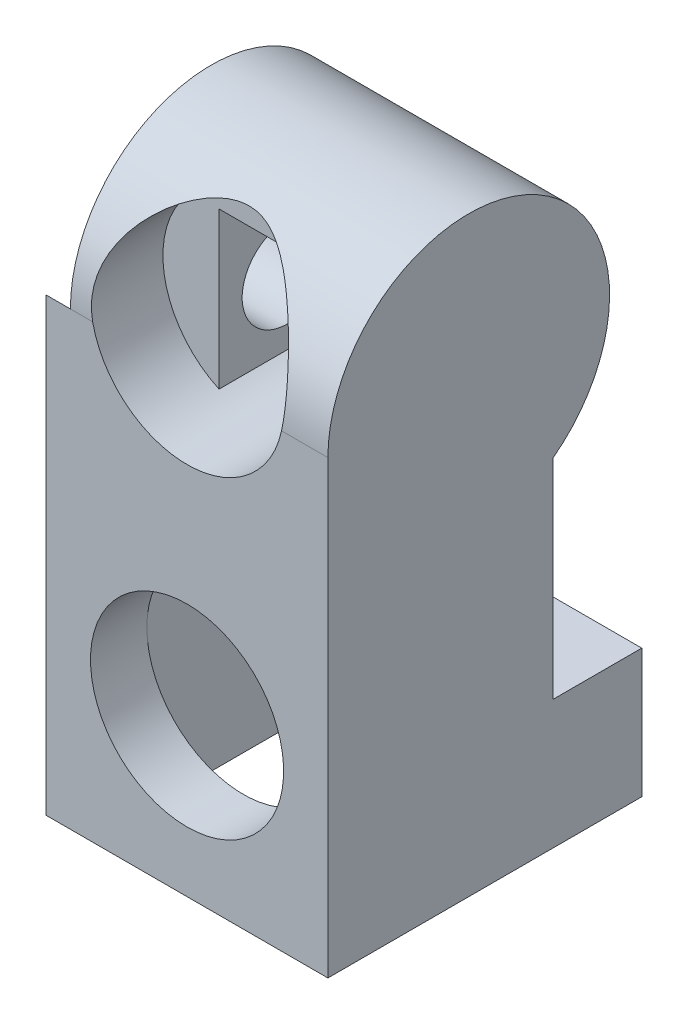
ISO-10303-21;
HEADER;
FILE_DESCRIPTION(('STEP AP214'),'2;1');
FILE_NAME('part.step','',(''),(''),'','','');
FILE_SCHEMA(('AUTOMOTIVE_DESIGN { 1 0 10303 214 1 1 1 1 }'));
ENDSEC;
DATA;
#1=APPLICATION_CONTEXT('core data for automotive mechanical design processes');
#2=APPLICATION_PROTOCOL_DEFINITION('international standard','automotive_design',2000,#1);
#3=PRODUCT_CONTEXT('',#1,'mechanical');
#4=PRODUCT('Part','Part','',(#3));
#5=PRODUCT_RELATED_PRODUCT_CATEGORY('part','',(#4));
#6=PRODUCT_DEFINITION_FORMATION('','',#4);
#7=PRODUCT_DEFINITION_CONTEXT('part definition',#1,'design');
#8=PRODUCT_DEFINITION('design','',#6,#7);
#9=PRODUCT_DEFINITION_SHAPE('','',#8);
#10=(LENGTH_UNIT() NAMED_UNIT(*) SI_UNIT(.MILLI.,.METRE.));
#11=(NAMED_UNIT(*) PLANE_ANGLE_UNIT() SI_UNIT($,.RADIAN.));
#12=(NAMED_UNIT(*) SI_UNIT($,.STERADIAN.) SOLID_ANGLE_UNIT());
#13=UNCERTAINTY_MEASURE_WITH_UNIT(LENGTH_MEASURE(1.E-05),#10,'distance_accuracy_value','');
#14=(GEOMETRIC_REPRESENTATION_CONTEXT(3) GLOBAL_UNCERTAINTY_ASSIGNED_CONTEXT((#13)) GLOBAL_UNIT_ASSIGNED_CONTEXT((#10,
#11,#12)) REPRESENTATION_CONTEXT('',''));
#15=CARTESIAN_POINT('',(0.,0.,0.));
#16=DIRECTION('',(0.,0.,1.));
#17=DIRECTION('',(1.,0.,0.));
#18=AXIS2_PLACEMENT_3D('',#15,#16,#17);
#19=CARTESIAN_POINT('',(-3.5,0.499999999999999,1.7));
#20=DIRECTION('',(0.,0.,1.));
#21=DIRECTION('',(0.,1.,0.));
#22=AXIS2_PLACEMENT_3D('',#19,#20,#21);
#23=PLANE('',#22);
#24=DIRECTION('',(-1.,0.,0.));
#25=VECTOR('',#24,1.);
#26=CARTESIAN_POINT('',(0.,2.2,1.7));
#27=LINE('',#26,#25);
#28=CARTESIAN_POINT('',(-1.80589256539026,2.2,1.7));
#29=VERTEX_POINT('',#28);
#30=CARTESIAN_POINT('',(-4.50589256539026,2.2,1.7));
#31=VERTEX_POINT('',#30);
#32=EDGE_CURVE('E198',#29,#31,#27,.T.);
#33=ORIENTED_EDGE('',*,*,#32,.F.);
#34=CARTESIAN_POINT('',(-3.5,0.499999999999999,1.7));
#35=DIRECTION('',(0.,0.,-1.));
#36=DIRECTION('',(0.,1.,0.));
#37=AXIS2_PLACEMENT_3D('',#34,#35,#36);
#38=CIRCLE('',#37,2.4);
#39=CARTESIAN_POINT('',(-4.50589256539026,-1.67903192883735,1.7));
#40=VERTEX_POINT('',#39);
#41=EDGE_CURVE('E200',#40,#29,#38,.T.);
#42=ORIENTED_EDGE('',*,*,#41,.F.);
#43=DIRECTION('',(0.,-1.,0.));
#44=VECTOR('',#43,1.);
#45=CARTESIAN_POINT('',(-4.50589256539026,0.,1.7));
#46=LINE('',#45,#44);
#47=EDGE_CURVE('E190',#31,#40,#46,.T.);
#48=ORIENTED_EDGE('',*,*,#47,.F.);
#49=EDGE_LOOP('',(#33,#42,#48));
#50=FACE_BOUND('',#49,.T.);
#51=ADVANCED_FACE('F43',(#50),#23,.T.);
#52=CARTESIAN_POINT('',(-1.80589256539026,-1.2,1.7));
#53=VERTEX_POINT('',#52);
#54=EDGE_CURVE('E401',#29,#53,#38,.T.);
#55=ORIENTED_EDGE('',*,*,#54,.F.);
#56=DIRECTION('',(0.,1.,0.));
#57=VECTOR('',#56,1.);
#58=CARTESIAN_POINT('',(-1.80589256539026,0.,1.7));
#59=LINE('',#58,#57);
#60=EDGE_CURVE('E392',#53,#29,#59,.T.);
#61=ORIENTED_EDGE('',*,*,#60,.F.);
#62=EDGE_LOOP('',(#55,#61));
#63=FACE_BOUND('',#62,.T.);
#64=ADVANCED_FACE('F256',(#63),#23,.T.);
#65=CARTESIAN_POINT('',(0.,-2.3,2.1));
#66=DIRECTION('',(0.,0.,1.));
#67=DIRECTION('',(0.,1.,0.));
#68=AXIS2_PLACEMENT_3D('',#65,#66,#67);
#69=PLANE('',#68);
#70=DIRECTION('',(0.,-1.,0.));
#71=VECTOR('',#70,1.);
#72=CARTESIAN_POINT('',(-1.1,-2.3,2.1));
#73=LINE('',#72,#71);
#74=CARTESIAN_POINT('',(-1.1,-7.3,2.1));
#75=VERTEX_POINT('',#74);
#76=CARTESIAN_POINT('',(-1.1,-11.2,2.1));
#77=VERTEX_POINT('',#76);
#78=EDGE_CURVE('E310',#75,#77,#73,.T.);
#79=ORIENTED_EDGE('',*,*,#78,.T.);
#80=DIRECTION('',(1.,0.,0.));
#81=VECTOR('',#80,1.);
#82=CARTESIAN_POINT('',(0.,-11.2,2.1));
#83=LINE('',#82,#81);
#84=CARTESIAN_POINT('',(-5.9,-11.2,2.1));
#85=VERTEX_POINT('',#84);
#86=EDGE_CURVE('E297',#85,#77,#83,.T.);
#87=ORIENTED_EDGE('',*,*,#86,.F.);
#88=DIRECTION('',(0.,-1.,0.));
#89=VECTOR('',#88,1.);
#90=CARTESIAN_POINT('',(-5.9,-2.3,2.1));
#91=LINE('',#90,#89);
#92=CARTESIAN_POINT('',(-5.9,-7.3,2.1));
#93=VERTEX_POINT('',#92);
#94=EDGE_CURVE('E322',#93,#85,#91,.T.);
#95=ORIENTED_EDGE('',*,*,#94,.F.);
#96=CARTESIAN_POINT('',(-3.5,-7.3,2.1));
#97=DIRECTION('',(0.,0.,-1.));
#98=DIRECTION('',(0.,1.,0.));
#99=AXIS2_PLACEMENT_3D('',#96,#97,#98);
#100=CIRCLE('',#99,2.4);
#101=EDGE_CURVE('E278',#75,#93,#100,.T.);
#102=ORIENTED_EDGE('',*,*,#101,.F.);
#103=EDGE_LOOP('',(#79,#87,#95,#102));
#104=FACE_BOUND('',#103,.T.);
#105=ADVANCED_FACE('F260',(#104),#69,.F.);
#106=CARTESIAN_POINT('',(-7.,-11.2,0.));
#107=DIRECTION('',(0.,1.,0.));
#108=DIRECTION('',(0.,0.,-1.));
#109=AXIS2_PLACEMENT_3D('',#106,#107,#108);
#110=PLANE('',#109);
#111=DIRECTION('',(0.,0.,-1.));
#112=VECTOR('',#111,1.);
#113=CARTESIAN_POINT('',(0.,-11.2,0.));
#114=LINE('',#113,#112);
#115=CARTESIAN_POINT('',(0.,-11.2,3.5));
#116=VERTEX_POINT('',#115);
#117=CARTESIAN_POINT('',(0.,-11.2,-4.3));
#118=VERTEX_POINT('',#117);
#119=EDGE_CURVE('E357',#116,#118,#114,.T.);
#120=ORIENTED_EDGE('',*,*,#119,.F.);
#121=DIRECTION('',(1.,0.,0.));
#122=VECTOR('',#121,1.);
#123=CARTESIAN_POINT('',(-7.,-11.2,3.5));
#124=LINE('',#123,#122);
#125=CARTESIAN_POINT('',(-7.,-11.2,3.5));
#126=VERTEX_POINT('',#125);
#127=EDGE_CURVE('E366',#126,#116,#124,.T.);
#128=ORIENTED_EDGE('',*,*,#127,.F.);
#129=DIRECTION('',(0.,0.,-1.));
#130=VECTOR('',#129,1.);
#131=CARTESIAN_POINT('',(-7.,-11.2,0.));
#132=LINE('',#131,#130);
#133=CARTESIAN_POINT('',(-7.,-11.2,-4.3));
#134=VERTEX_POINT('',#133);
#135=EDGE_CURVE('E344',#126,#134,#132,.T.);
#136=ORIENTED_EDGE('',*,*,#135,.T.);
#137=DIRECTION('',(1.,0.,0.));
#138=VECTOR('',#137,1.);
#139=CARTESIAN_POINT('',(-7.,-11.2,-4.3));
#140=LINE('',#139,#138);
#141=EDGE_CURVE('E369',#134,#118,#140,.T.);
#142=ORIENTED_EDGE('',*,*,#141,.T.);
#143=EDGE_LOOP('',(#120,#128,#136,#142));
#144=FACE_BOUND('',#143,.T.);
#145=DIRECTION('',(0.,0.,-1.));
#146=VECTOR('',#145,1.);
#147=CARTESIAN_POINT('',(-5.9,-11.2,0.));
#148=LINE('',#147,#146);
#149=CARTESIAN_POINT('',(-5.9,-11.2,-2.9));
#150=VERTEX_POINT('',#149);
#151=EDGE_CURVE('E303',#85,#150,#148,.T.);
#152=ORIENTED_EDGE('',*,*,#151,.F.);
#153=ORIENTED_EDGE('',*,*,#86,.T.);
#154=DIRECTION('',(0.,0.,-1.));
#155=VECTOR('',#154,1.);
#156=CARTESIAN_POINT('',(-1.1,-11.2,0.));
#157=LINE('',#156,#155);
#158=CARTESIAN_POINT('',(-1.1,-11.2,-2.9));
#159=VERTEX_POINT('',#158);
#160=EDGE_CURVE('E313',#77,#159,#157,.T.);
#161=ORIENTED_EDGE('',*,*,#160,.T.);
#162=DIRECTION('',(1.,0.,0.));
#163=VECTOR('',#162,1.);
#164=CARTESIAN_POINT('',(0.,-11.2,-2.9));
#165=LINE('',#164,#163);
#166=EDGE_CURVE('E277',#150,#159,#165,.T.);
#167=ORIENTED_EDGE('',*,*,#166,.F.);
#168=EDGE_LOOP('',(#152,#153,#161,#167));
#169=FACE_BOUND('',#168,.T.);
#170=ADVANCED_FACE('F430',(#144,#169),#110,.F.);
#171=CARTESIAN_POINT('',(0.,-2.3,-1.2));
#172=DIRECTION('',(0.,0.,1.));
#173=DIRECTION('',(0.,1.,0.));
#174=AXIS2_PLACEMENT_3D('',#171,#172,#173);
#175=PLANE('',#174);
#176=DIRECTION('',(0.,-1.,0.));
#177=VECTOR('',#176,1.);
#178=CARTESIAN_POINT('',(-1.1,-2.3,-1.2));
#179=LINE('',#178,#177);
#180=CARTESIAN_POINT('',(-1.1,-2.3,-1.2));
#181=VERTEX_POINT('',#180);
#182=CARTESIAN_POINT('',(-1.1,-9.2,-1.2));
#183=VERTEX_POINT('',#182);
#184=EDGE_CURVE('E326',#181,#183,#179,.T.);
#185=ORIENTED_EDGE('',*,*,#184,.F.);
#186=DIRECTION('',(1.,0.,0.));
#187=VECTOR('',#186,1.);
#188=CARTESIAN_POINT('',(0.,-2.3,-1.2));
#189=LINE('',#188,#187);
#190=CARTESIAN_POINT('',(-5.9,-2.3,-1.2));
#191=VERTEX_POINT('',#190);
#192=EDGE_CURVE('E305',#191,#181,#189,.T.);
#193=ORIENTED_EDGE('',*,*,#192,.F.);
#194=DIRECTION('',(0.,-1.,0.));
#195=VECTOR('',#194,1.);
#196=CARTESIAN_POINT('',(-5.9,-2.3,-1.2));
#197=LINE('',#196,#195);
#198=CARTESIAN_POINT('',(-5.9,-9.2,-1.2));
#199=VERTEX_POINT('',#198);
#200=EDGE_CURVE('E323',#191,#199,#197,.T.);
#201=ORIENTED_EDGE('',*,*,#200,.T.);
#202=DIRECTION('',(1.,0.,0.));
#203=VECTOR('',#202,1.);
#204=CARTESIAN_POINT('',(0.,-9.2,-1.2));
#205=LINE('',#204,#203);
#206=EDGE_CURVE('E281',#199,#183,#205,.T.);
#207=ORIENTED_EDGE('',*,*,#206,.T.);
#208=EDGE_LOOP('',(#185,#193,#201,#207));
#209=FACE_BOUND('',#208,.T.);
#210=ADVANCED_FACE('F440',(#209),#175,.T.);
#211=CARTESIAN_POINT('',(-6.4,0.,0.));
#212=DIRECTION('',(1.,0.,0.));
#213=DIRECTION('',(0.,0.,1.));
#214=AXIS2_PLACEMENT_3D('',#211,#212,#213);
#215=CYLINDRICAL_SURFACE('',#214,3.5);
#216=CARTESIAN_POINT('',(-5.8473389188611,0.,3.5));
#217=CARTESIAN_POINT('',(-5.85952324799212,0.0571477217374245,3.50001181867057));
#218=CARTESIAN_POINT('',(-5.86959863933398,0.114743770065322,3.49860061614223));
#219=CARTESIAN_POINT('',(-5.88551560428378,0.230360407827148,3.49288728833139));
#220=CARTESIAN_POINT('',(-5.89135828784083,0.288380881929227,3.48858592151156));
#221=CARTESIAN_POINT('',(-5.8987800738924,0.404089359673819,3.47707880110764));
#222=CARTESIAN_POINT('',(-5.90038218120077,0.461777456069779,3.46988896332483));
#223=CARTESIAN_POINT('',(-5.89946378384657,0.576676567862824,3.45265487837301));
#224=CARTESIAN_POINT('',(-5.89694326407962,0.633887581511211,3.44261062074615));
#225=CARTESIAN_POINT('',(-5.88336595556229,0.804105036209102,3.4083356117771));
#226=CARTESIAN_POINT('',(-5.86630384227635,0.915869866292524,3.37994514796454));
#227=CARTESIAN_POINT('',(-5.8176646602164,1.13314832429677,3.31344895138059));
#228=CARTESIAN_POINT('',(-5.78607230536925,1.23865523648251,3.27533300607753));
#229=CARTESIAN_POINT('',(-5.70809491628295,1.44731564674367,3.18884504357403));
#230=CARTESIAN_POINT('',(-5.66097838899282,1.55000373794561,3.14001706082533));
#231=CARTESIAN_POINT('',(-5.55467670041225,1.74526360748642,3.03584021966201));
#232=CARTESIAN_POINT('',(-5.49548649772665,1.83783113507598,2.98048864139242));
#233=CARTESIAN_POINT('',(-5.35353573776811,2.03018562272158,2.85379750966277));
#234=CARTESIAN_POINT('',(-5.26842986956987,2.12760502281981,2.78149734246403));
#235=CARTESIAN_POINT('',(-5.08471660055204,2.30698502977076,2.63462775579363));
#236=CARTESIAN_POINT('',(-4.98609165576466,2.38892521486053,2.56005548720432));
#237=CARTESIAN_POINT('',(-4.78326463330636,2.53162908276111,2.41871956278776));
#238=CARTESIAN_POINT('',(-4.67995301376685,2.59348192527748,2.3517770338946));
#239=CARTESIAN_POINT('',(-4.46138451080996,2.70240840583052,2.22572729179699));
#240=CARTESIAN_POINT('',(-4.34615403536233,2.74951382379002,2.16660339102304));
#241=CARTESIAN_POINT('',(-4.14772757712701,2.81234304649958,2.08383834027692));
#242=CARTESIAN_POINT('',(-4.06831867472429,2.83323788763357,2.05514190190293));
#243=CARTESIAN_POINT('',(-3.90499381872968,2.86704539023274,2.0077106103014));
#244=CARTESIAN_POINT('',(-3.82108827656746,2.87997569256307,1.98895375460871));
#245=CARTESIAN_POINT('',(-3.64949120839477,2.89690144617537,1.9642337035912));
#246=CARTESIAN_POINT('',(-3.56176894903616,2.9008005995437,1.95840842288825));
#247=CARTESIAN_POINT('',(-3.38665261282273,2.89892227463506,1.96118525247281));
#248=CARTESIAN_POINT('',(-3.2992586376826,2.89314201115589,1.96979151536346));
#249=CARTESIAN_POINT('',(-3.11997573015766,2.8716013071517,2.00106904761721));
#250=CARTESIAN_POINT('',(-3.02841815728649,2.85496763238069,2.02496702821199));
#251=CARTESIAN_POINT('',(-2.85105317430008,2.81241019263363,2.08366151371945));
#252=CARTESIAN_POINT('',(-2.76526360077856,2.78645905439294,2.11849009267811));
#253=CARTESIAN_POINT('',(-2.61773079012411,2.73301571417905,2.18679788954713));
#254=CARTESIAN_POINT('',(-2.55478723431316,2.70705840232988,2.21895300854012));
#255=CARTESIAN_POINT('',(-2.43253952688268,2.6505953738598,2.28610481874926));
#256=CARTESIAN_POINT('',(-2.37323749385825,2.62008704424715,2.32110313711189));
#257=CARTESIAN_POINT('',(-2.20045968614499,2.52207206221611,2.42868720689749));
#258=CARTESIAN_POINT('',(-2.09218099861509,2.44810107186269,2.50382746204864));
#259=CARTESIAN_POINT('',(-1.88360823330201,2.27939132717921,2.65861963929727));
#260=CARTESIAN_POINT('',(-1.78407812901597,2.18373583955496,2.73829291655651));
#261=CARTESIAN_POINT('',(-1.60137340449738,1.97459276266238,2.89271972414267));
#262=CARTESIAN_POINT('',(-1.51817479248159,1.86113177857625,2.96748036225121));
#263=CARTESIAN_POINT('',(-1.38270764696269,1.63641660452186,3.09615262794246));
#264=CARTESIAN_POINT('',(-1.32762439761678,1.52768128659245,3.15148910825451));
#265=CARTESIAN_POINT('',(-1.23355837193325,1.29903752936263,3.25238946581503));
#266=CARTESIAN_POINT('',(-1.19457083515538,1.17913240650188,3.29795623061859));
#267=CARTESIAN_POINT('',(-1.15017085451829,0.992412245075306,3.35700281785587));
#268=CARTESIAN_POINT('',(-1.13769076115729,0.928685601014822,3.37520301505509));
#269=CARTESIAN_POINT('',(-1.11787508897714,0.799562026687033,3.40809707788925));
#270=CARTESIAN_POINT('',(-1.11053670135105,0.734166028622351,3.42279285501696));
#271=CARTESIAN_POINT('',(-1.1012748142032,0.602361890112999,3.44842924317227));
#272=CARTESIAN_POINT('',(-1.09934358386222,0.53595533132392,3.45937519578144));
#273=CARTESIAN_POINT('',(-1.10104813363846,0.402723056835072,3.47740236223998));
#274=CARTESIAN_POINT('',(-1.10468020548551,0.335897649885473,3.4844861461866));
#275=CARTESIAN_POINT('',(-1.1154853741884,0.224046580330871,3.49311564200003));
#276=CARTESIAN_POINT('',(-1.12113712347402,0.178946589127799,3.49571088870466));
#277=CARTESIAN_POINT('',(-1.1349923537418,0.0891432677126922,3.49915350020635));
#278=CARTESIAN_POINT('',(-1.14319194086814,0.0444394385561715,3.50000351725482));
#279=CARTESIAN_POINT('',(-1.15266108113889,0.,3.5));
#280=B_SPLINE_CURVE_WITH_KNOTS('',3,(#216,#217,#218,#219,#220,#221,#222,#223,#224,#225,#226,
#227,#228,#229,#230,#231,#232,#233,#234,#235,#236,#237,#238,#239,#240,#241,#242,#243,#244,#245,
#246,#247,#248,#249,#250,#251,#252,#253,#254,#255,#256,#257,#258,#259,#260,#261,#262,#263,#264,
#265,#266,#267,#268,#269,#270,#271,#272,#273,#274,#275,#276,#277,#278,#279),.UNSPECIFIED.,.F.,
.F.,(4,2,2,2,2,2,2,2,2,2,2,2,2,2,2,2,2,2,2,2,2,2,2,2,2,2,2,2,2,2,2,4),(0.,0.175237440381033,
0.35042891134353,0.524668014814338,0.698907756660255,1.04686867533735,1.39519649537508,
1.76309807782818,2.13115359418281,2.57414809278723,3.01772301461145,3.42986501795747,
3.84111266440891,4.10124897819194,4.36080701764205,4.62312019539684,4.88550886538463,
5.17215450827924,5.45964925644542,5.68524281978454,5.91096641102046,6.36265437457839,
6.83912330739456,7.31488695708917,7.71498529590946,8.1149652174138,8.31702682714792,
8.51897796858323,8.720640224955,8.92216811998134,9.05864817270439,9.19492066068158),.UNSPECIFIED.);
#281=CARTESIAN_POINT('',(-5.8473389188611,0.,3.5));
#282=VERTEX_POINT('',#281);
#283=CARTESIAN_POINT('',(-1.1526610811389,0.,3.5));
#284=VERTEX_POINT('',#283);
#285=EDGE_CURVE('E269',#282,#284,#280,.T.);
#286=ORIENTED_EDGE('',*,*,#285,.T.);
#287=DIRECTION('',(1.,0.,0.));
#288=VECTOR('',#287,1.);
#289=CARTESIAN_POINT('',(-7.,0.,3.5));
#290=LINE('',#289,#288);
#291=CARTESIAN_POINT('',(0.,0.,3.5));
#292=VERTEX_POINT('',#291);
#293=EDGE_CURVE('E365',#284,#292,#290,.T.);
#294=ORIENTED_EDGE('',*,*,#293,.T.);
#295=CARTESIAN_POINT('',(0.,0.,0.));
#296=DIRECTION('',(-1.,0.,0.));
#297=DIRECTION('',(0.,0.,1.));
#298=AXIS2_PLACEMENT_3D('',#295,#296,#297);
#299=CIRCLE('',#298,3.5);
#300=CARTESIAN_POINT('',(0.,-2.8,-2.1));
#301=VERTEX_POINT('',#300);
#302=EDGE_CURVE('E55',#292,#301,#299,.T.);
#303=ORIENTED_EDGE('',*,*,#302,.T.);
#304=DIRECTION('',(1.,0.,0.));
#305=VECTOR('',#304,1.);
#306=CARTESIAN_POINT('',(-7.,-2.8,-2.1));
#307=LINE('',#306,#305);
#308=CARTESIAN_POINT('',(-6.4,-2.8,-2.1));
#309=VERTEX_POINT('',#308);
#310=EDGE_CURVE('E349',#309,#301,#307,.T.);
#311=ORIENTED_EDGE('',*,*,#310,.F.);
#312=CARTESIAN_POINT('',(-6.4,0.,0.));
#313=DIRECTION('',(-1.,0.,0.));
#314=DIRECTION('',(0.,0.,1.));
#315=AXIS2_PLACEMENT_3D('',#312,#313,#314);
#316=CIRCLE('',#315,3.5);
#317=CARTESIAN_POINT('',(-6.4,0.,3.5));
#318=VERTEX_POINT('',#317);
#319=EDGE_CURVE('E12',#318,#309,#316,.T.);
#320=ORIENTED_EDGE('',*,*,#319,.F.);
#321=EDGE_CURVE('E364',#318,#282,#290,.T.);
#322=ORIENTED_EDGE('',*,*,#321,.T.);
#323=EDGE_LOOP('',(#286,#294,#303,#311,#320,#322));
#324=FACE_BOUND('',#323,.T.);
#325=ADVANCED_FACE('F45',(#324),#215,.T.);
#326=CARTESIAN_POINT('',(-6.4,0.,0.));
#327=DIRECTION('',(1.,0.,0.));
#328=DIRECTION('',(0.,0.,1.));
#329=AXIS2_PLACEMENT_3D('',#326,#327,#328);
#330=PLANE('',#329);
#331=CARTESIAN_POINT('',(-6.4,0.,0.));
#332=DIRECTION('',(1.,0.,0.));
#333=DIRECTION('',(0.,0.,-1.));
#334=AXIS2_PLACEMENT_3D('',#331,#332,#333);
#335=CIRCLE('',#334,1.125);
#336=CARTESIAN_POINT('',(-6.4,0.,-1.125));
#337=VERTEX_POINT('',#336);
#338=EDGE_CURVE('E205',#337,#337,#335,.T.);
#339=ORIENTED_EDGE('',*,*,#338,.T.);
#340=EDGE_LOOP('',(#339));
#341=FACE_BOUND('',#340,.T.);
#342=ORIENTED_EDGE('',*,*,#319,.T.);
#343=CARTESIAN_POINT('',(-6.4,0.,0.));
#344=DIRECTION('',(-1.,0.,0.));
#345=DIRECTION('',(0.,0.,1.));
#346=AXIS2_PLACEMENT_3D('',#343,#344,#345);
#347=CIRCLE('',#346,3.5);
#348=EDGE_CURVE('E363',#309,#318,#347,.T.);
#349=ORIENTED_EDGE('',*,*,#348,.T.);
#350=EDGE_LOOP('',(#342,#349));
#351=FACE_BOUND('',#350,.T.);
#352=ADVANCED_FACE('F487',(#341,#351),#330,.F.);
#353=CARTESIAN_POINT('',(0.,0.,0.));
#354=DIRECTION('',(1.,0.,0.));
#355=DIRECTION('',(0.,0.,1.));
#356=AXIS2_PLACEMENT_3D('',#353,#354,#355);
#357=PLANE('',#356);
#358=ORIENTED_EDGE('',*,*,#302,.F.);
#359=DIRECTION('',(0.,-1.,0.));
#360=VECTOR('',#359,1.);
#361=CARTESIAN_POINT('',(0.,0.,3.5));
#362=LINE('',#361,#360);
#363=EDGE_CURVE('E336',#292,#116,#362,.T.);
#364=ORIENTED_EDGE('',*,*,#363,.T.);
#365=ORIENTED_EDGE('',*,*,#119,.T.);
#366=DIRECTION('',(0.,1.,0.));
#367=VECTOR('',#366,1.);
#368=CARTESIAN_POINT('',(0.,0.,-4.29999999999999));
#369=LINE('',#368,#367);
#370=CARTESIAN_POINT('',(0.,-8.,-4.3));
#371=VERTEX_POINT('',#370);
#372=EDGE_CURVE('E354',#118,#371,#369,.T.);
#373=ORIENTED_EDGE('',*,*,#372,.T.);
#374=DIRECTION('',(0.,0.,1.));
#375=VECTOR('',#374,1.);
#376=CARTESIAN_POINT('',(0.,-8.,0.));
#377=LINE('',#376,#375);
#378=CARTESIAN_POINT('',(0.,-8.,-2.1));
#379=VERTEX_POINT('',#378);
#380=EDGE_CURVE('E351',#371,#379,#377,.T.);
#381=ORIENTED_EDGE('',*,*,#380,.T.);
#382=DIRECTION('',(0.,1.,0.));
#383=VECTOR('',#382,1.);
#384=CARTESIAN_POINT('',(0.,0.,-2.1));
#385=LINE('',#384,#383);
#386=EDGE_CURVE('E321',#379,#301,#385,.T.);
#387=ORIENTED_EDGE('',*,*,#386,.T.);
#388=EDGE_LOOP('',(#358,#364,#365,#373,#381,#387));
#389=FACE_BOUND('',#388,.T.);
#390=ADVANCED_FACE('F485',(#389),#357,.T.);
#391=CARTESIAN_POINT('',(-7.,0.,0.));
#392=DIRECTION('',(1.,0.,0.));
#393=DIRECTION('',(0.,0.,1.));
#394=AXIS2_PLACEMENT_3D('',#391,#392,#393);
#395=CYLINDRICAL_SURFACE('',#394,3.5);
#396=CARTESIAN_POINT('',(-7.,-2.8,-2.1));
#397=VERTEX_POINT('',#396);
#398=EDGE_CURVE('E376',#397,#309,#307,.T.);
#399=ORIENTED_EDGE('',*,*,#398,.F.);
#400=CARTESIAN_POINT('',(-7.,0.,0.));
#401=DIRECTION('',(-1.,0.,0.));
#402=DIRECTION('',(0.,0.,1.));
#403=AXIS2_PLACEMENT_3D('',#400,#401,#402);
#404=CIRCLE('',#403,3.5);
#405=CARTESIAN_POINT('',(-7.,0.,3.5));
#406=VERTEX_POINT('',#405);
#407=EDGE_CURVE('E332',#397,#406,#404,.T.);
#408=ORIENTED_EDGE('',*,*,#407,.T.);
#409=EDGE_CURVE('E361',#406,#318,#290,.T.);
#410=ORIENTED_EDGE('',*,*,#409,.T.);
#411=ORIENTED_EDGE('',*,*,#348,.F.);
#412=EDGE_LOOP('',(#399,#408,#410,#411));
#413=FACE_BOUND('',#412,.T.);
#414=ADVANCED_FACE('F469',(#413),#395,.F.);
#415=CARTESIAN_POINT('',(-7.,0.,3.5));
#416=DIRECTION('',(0.,0.,-1.));
#417=DIRECTION('',(0.,-1.,0.));
#418=AXIS2_PLACEMENT_3D('',#415,#416,#417);
#419=PLANE('',#418);
#420=CARTESIAN_POINT('',(-3.5,-7.3,3.5));
#421=DIRECTION('',(0.,0.,-1.));
#422=DIRECTION('',(0.,1.,0.));
#423=AXIS2_PLACEMENT_3D('',#420,#421,#422);
#424=CIRCLE('',#423,2.4);
#425=CARTESIAN_POINT('',(-3.5,-4.9,3.5));
#426=VERTEX_POINT('',#425);
#427=EDGE_CURVE('E201',#426,#426,#424,.T.);
#428=ORIENTED_EDGE('',*,*,#427,.T.);
#429=EDGE_LOOP('',(#428));
#430=FACE_BOUND('',#429,.T.);
#431=ORIENTED_EDGE('',*,*,#321,.F.);
#432=ORIENTED_EDGE('',*,*,#409,.F.);
#433=DIRECTION('',(0.,-1.,0.));
#434=VECTOR('',#433,1.);
#435=CARTESIAN_POINT('',(-7.,0.,3.5));
#436=LINE('',#435,#434);
#437=EDGE_CURVE('E347',#406,#126,#436,.T.);
#438=ORIENTED_EDGE('',*,*,#437,.T.);
#439=ORIENTED_EDGE('',*,*,#127,.T.);
#440=ORIENTED_EDGE('',*,*,#363,.F.);
#441=ORIENTED_EDGE('',*,*,#293,.F.);
#442=CARTESIAN_POINT('',(-3.5,0.499999999999999,3.5));
#443=DIRECTION('',(0.,0.,-1.));
#444=DIRECTION('',(0.,1.,0.));
#445=AXIS2_PLACEMENT_3D('',#442,#443,#444);
#446=CIRCLE('',#445,2.4);
#447=EDGE_CURVE('E70',#284,#282,#446,.T.);
#448=ORIENTED_EDGE('',*,*,#447,.T.);
#449=EDGE_LOOP('',(#431,#432,#438,#439,#440,#441,#448));
#450=FACE_BOUND('',#449,.T.);
#451=ADVANCED_FACE('F406',(#430,#450),#419,.F.);
#452=CARTESIAN_POINT('',(-7.,0.,-4.29999999999999));
#453=DIRECTION('',(0.,0.,1.));
#454=DIRECTION('',(0.,1.,0.));
#455=AXIS2_PLACEMENT_3D('',#452,#453,#454);
#456=PLANE('',#455);
#457=ORIENTED_EDGE('',*,*,#372,.F.);
#458=ORIENTED_EDGE('',*,*,#141,.F.);
#459=DIRECTION('',(0.,1.,0.));
#460=VECTOR('',#459,1.);
#461=CARTESIAN_POINT('',(-7.,0.,-4.29999999999999));
#462=LINE('',#461,#460);
#463=CARTESIAN_POINT('',(-7.,-8.,-4.3));
#464=VERTEX_POINT('',#463);
#465=EDGE_CURVE('E341',#134,#464,#462,.T.);
#466=ORIENTED_EDGE('',*,*,#465,.T.);
#467=DIRECTION('',(1.,0.,0.));
#468=VECTOR('',#467,1.);
#469=CARTESIAN_POINT('',(-7.,-8.,-4.3));
#470=LINE('',#469,#468);
#471=EDGE_CURVE('E372',#464,#371,#470,.T.);
#472=ORIENTED_EDGE('',*,*,#471,.T.);
#473=EDGE_LOOP('',(#457,#458,#466,#472));
#474=FACE_BOUND('',#473,.T.);
#475=ADVANCED_FACE('F468',(#474),#456,.F.);
#476=CARTESIAN_POINT('',(-7.,-8.,0.));
#477=DIRECTION('',(0.,-1.,0.));
#478=DIRECTION('',(0.,0.,1.));
#479=AXIS2_PLACEMENT_3D('',#476,#477,#478);
#480=PLANE('',#479);
#481=ORIENTED_EDGE('',*,*,#380,.F.);
#482=ORIENTED_EDGE('',*,*,#471,.F.);
#483=DIRECTION('',(0.,0.,1.));
#484=VECTOR('',#483,1.);
#485=CARTESIAN_POINT('',(-7.,-8.,0.));
#486=LINE('',#485,#484);
#487=CARTESIAN_POINT('',(-7.,-8.,-2.1));
#488=VERTEX_POINT('',#487);
#489=EDGE_CURVE('E338',#464,#488,#486,.T.);
#490=ORIENTED_EDGE('',*,*,#489,.T.);
#491=DIRECTION('',(1.,0.,0.));
#492=VECTOR('',#491,1.);
#493=CARTESIAN_POINT('',(-7.,-8.,-2.1));
#494=LINE('',#493,#492);
#495=EDGE_CURVE('E374',#488,#379,#494,.T.);
#496=ORIENTED_EDGE('',*,*,#495,.T.);
#497=EDGE_LOOP('',(#481,#482,#490,#496));
#498=FACE_BOUND('',#497,.T.);
#499=ADVANCED_FACE('F475',(#498),#480,.F.);
#500=CARTESIAN_POINT('',(-7.,0.,-2.1));
#501=DIRECTION('',(0.,0.,1.));
#502=DIRECTION('',(0.,1.,0.));
#503=AXIS2_PLACEMENT_3D('',#500,#501,#502);
#504=PLANE('',#503);
#505=ORIENTED_EDGE('',*,*,#386,.F.);
#506=ORIENTED_EDGE('',*,*,#495,.F.);
#507=DIRECTION('',(0.,1.,0.));
#508=VECTOR('',#507,1.);
#509=CARTESIAN_POINT('',(-7.,0.,-2.1));
#510=LINE('',#509,#508);
#511=EDGE_CURVE('E335',#488,#397,#510,.T.);
#512=ORIENTED_EDGE('',*,*,#511,.T.);
#513=ORIENTED_EDGE('',*,*,#398,.T.);
#514=ORIENTED_EDGE('',*,*,#310,.T.);
#515=EDGE_LOOP('',(#505,#506,#512,#513,#514));
#516=FACE_BOUND('',#515,.T.);
#517=ADVANCED_FACE('F464',(#516),#504,.F.);
#518=CARTESIAN_POINT('',(-7.,0.,0.));
#519=DIRECTION('',(1.,0.,0.));
#520=DIRECTION('',(0.,0.,1.));
#521=AXIS2_PLACEMENT_3D('',#518,#519,#520);
#522=PLANE('',#521);
#523=ORIENTED_EDGE('',*,*,#407,.F.);
#524=ORIENTED_EDGE('',*,*,#511,.F.);
#525=ORIENTED_EDGE('',*,*,#489,.F.);
#526=ORIENTED_EDGE('',*,*,#465,.F.);
#527=ORIENTED_EDGE('',*,*,#135,.F.);
#528=ORIENTED_EDGE('',*,*,#437,.F.);
#529=EDGE_LOOP('',(#523,#524,#525,#526,#527,#528));
#530=FACE_BOUND('',#529,.T.);
#531=ADVANCED_FACE('F461',(#530),#522,.F.);
#532=CARTESIAN_POINT('',(-5.9,-2.3,2.1));
#533=VERTEX_POINT('',#532);
#534=EDGE_CURVE('E318',#533,#93,#91,.T.);
#535=ORIENTED_EDGE('',*,*,#534,.F.);
#536=DIRECTION('',(1.,0.,0.));
#537=VECTOR('',#536,1.);
#538=CARTESIAN_POINT('',(0.,-2.3,2.1));
#539=LINE('',#538,#537);
#540=CARTESIAN_POINT('',(-1.1,-2.3,2.1));
#541=VERTEX_POINT('',#540);
#542=EDGE_CURVE('E299',#533,#541,#539,.T.);
#543=ORIENTED_EDGE('',*,*,#542,.T.);
#544=EDGE_CURVE('E329',#541,#75,#73,.T.);
#545=ORIENTED_EDGE('',*,*,#544,.T.);
#546=EDGE_CURVE('E279',#93,#75,#100,.T.);
#547=ORIENTED_EDGE('',*,*,#546,.F.);
#548=EDGE_LOOP('',(#535,#543,#545,#547));
#549=FACE_BOUND('',#548,.T.);
#550=ADVANCED_FACE('F418',(#549),#69,.F.);
#551=CARTESIAN_POINT('',(-5.9,-2.3,0.));
#552=DIRECTION('',(1.,0.,0.));
#553=DIRECTION('',(0.,0.,1.));
#554=AXIS2_PLACEMENT_3D('',#551,#552,#553);
#555=PLANE('',#554);
#556=ORIENTED_EDGE('',*,*,#94,.T.);
#557=ORIENTED_EDGE('',*,*,#151,.T.);
#558=DIRECTION('',(0.,-1.,0.));
#559=VECTOR('',#558,1.);
#560=CARTESIAN_POINT('',(-5.9,-9.2,-2.9));
#561=LINE('',#560,#559);
#562=CARTESIAN_POINT('',(-5.9,-9.2,-2.9));
#563=VERTEX_POINT('',#562);
#564=EDGE_CURVE('E295',#563,#150,#561,.T.);
#565=ORIENTED_EDGE('',*,*,#564,.F.);
#566=DIRECTION('',(0.,0.,-1.));
#567=VECTOR('',#566,1.);
#568=CARTESIAN_POINT('',(-5.9,-9.2,0.));
#569=LINE('',#568,#567);
#570=EDGE_CURVE('E289',#199,#563,#569,.T.);
#571=ORIENTED_EDGE('',*,*,#570,.F.);
#572=ORIENTED_EDGE('',*,*,#200,.F.);
#573=DIRECTION('',(0.,0.,-1.));
#574=VECTOR('',#573,1.);
#575=CARTESIAN_POINT('',(-5.9,-2.3,0.));
#576=LINE('',#575,#574);
#577=EDGE_CURVE('E308',#533,#191,#576,.T.);
#578=ORIENTED_EDGE('',*,*,#577,.F.);
#579=ORIENTED_EDGE('',*,*,#534,.T.);
#580=EDGE_LOOP('',(#556,#557,#565,#571,#572,#578,#579));
#581=FACE_BOUND('',#580,.T.);
#582=ADVANCED_FACE('F433',(#581),#555,.T.);
#583=CARTESIAN_POINT('',(-1.1,-2.3,0.));
#584=DIRECTION('',(1.,0.,0.));
#585=DIRECTION('',(0.,0.,1.));
#586=AXIS2_PLACEMENT_3D('',#583,#584,#585);
#587=PLANE('',#586);
#588=ORIENTED_EDGE('',*,*,#544,.F.);
#589=DIRECTION('',(0.,0.,-1.));
#590=VECTOR('',#589,1.);
#591=CARTESIAN_POINT('',(-1.1,-2.3,0.));
#592=LINE('',#591,#590);
#593=EDGE_CURVE('E302',#541,#181,#592,.T.);
#594=ORIENTED_EDGE('',*,*,#593,.T.);
#595=ORIENTED_EDGE('',*,*,#184,.T.);
#596=DIRECTION('',(0.,0.,-1.));
#597=VECTOR('',#596,1.);
#598=CARTESIAN_POINT('',(-1.1,-9.2,0.));
#599=LINE('',#598,#597);
#600=CARTESIAN_POINT('',(-1.1,-9.2,-2.9));
#601=VERTEX_POINT('',#600);
#602=EDGE_CURVE('E284',#183,#601,#599,.T.);
#603=ORIENTED_EDGE('',*,*,#602,.T.);
#604=DIRECTION('',(0.,-1.,0.));
#605=VECTOR('',#604,1.);
#606=CARTESIAN_POINT('',(-1.1,-9.2,-2.9));
#607=LINE('',#606,#605);
#608=EDGE_CURVE('E292',#601,#159,#607,.T.);
#609=ORIENTED_EDGE('',*,*,#608,.T.);
#610=ORIENTED_EDGE('',*,*,#160,.F.);
#611=ORIENTED_EDGE('',*,*,#78,.F.);
#612=EDGE_LOOP('',(#588,#594,#595,#603,#609,#610,#611));
#613=FACE_BOUND('',#612,.T.);
#614=ADVANCED_FACE('F426',(#613),#587,.F.);
#615=CARTESIAN_POINT('',(0.,-2.3,0.));
#616=DIRECTION('',(0.,-1.,0.));
#617=DIRECTION('',(0.,0.,1.));
#618=AXIS2_PLACEMENT_3D('',#615,#616,#617);
#619=PLANE('',#618);
#620=ORIENTED_EDGE('',*,*,#542,.F.);
#621=ORIENTED_EDGE('',*,*,#577,.T.);
#622=ORIENTED_EDGE('',*,*,#192,.T.);
#623=ORIENTED_EDGE('',*,*,#593,.F.);
#624=EDGE_LOOP('',(#620,#621,#622,#623));
#625=FACE_BOUND('',#624,.T.);
#626=ADVANCED_FACE('F437',(#625),#619,.T.);
#627=CARTESIAN_POINT('',(0.,-9.2,-2.9));
#628=DIRECTION('',(0.,0.,1.));
#629=DIRECTION('',(0.,1.,0.));
#630=AXIS2_PLACEMENT_3D('',#627,#628,#629);
#631=PLANE('',#630);
#632=ORIENTED_EDGE('',*,*,#166,.T.);
#633=ORIENTED_EDGE('',*,*,#608,.F.);
#634=DIRECTION('',(1.,0.,0.));
#635=VECTOR('',#634,1.);
#636=CARTESIAN_POINT('',(0.,-9.2,-2.9));
#637=LINE('',#636,#635);
#638=EDGE_CURVE('E287',#563,#601,#637,.T.);
#639=ORIENTED_EDGE('',*,*,#638,.F.);
#640=ORIENTED_EDGE('',*,*,#564,.T.);
#641=EDGE_LOOP('',(#632,#633,#639,#640));
#642=FACE_BOUND('',#641,.T.);
#643=ADVANCED_FACE('F444',(#642),#631,.T.);
#644=CARTESIAN_POINT('',(0.,-9.2,0.));
#645=DIRECTION('',(0.,-1.,0.));
#646=DIRECTION('',(0.,0.,1.));
#647=AXIS2_PLACEMENT_3D('',#644,#645,#646);
#648=PLANE('',#647);
#649=ORIENTED_EDGE('',*,*,#206,.F.);
#650=ORIENTED_EDGE('',*,*,#570,.T.);
#651=ORIENTED_EDGE('',*,*,#638,.T.);
#652=ORIENTED_EDGE('',*,*,#602,.F.);
#653=EDGE_LOOP('',(#649,#650,#651,#652));
#654=FACE_BOUND('',#653,.T.);
#655=ADVANCED_FACE('F411',(#654),#648,.T.);
#656=CARTESIAN_POINT('',(-3.5,-7.3,1.7));
#657=DIRECTION('',(0.,0.,1.));
#658=DIRECTION('',(0.,1.,0.));
#659=AXIS2_PLACEMENT_3D('',#656,#657,#658);
#660=CYLINDRICAL_SURFACE('',#659,2.4);
#661=ORIENTED_EDGE('',*,*,#427,.F.);
#662=EDGE_LOOP('',(#661));
#663=FACE_BOUND('',#662,.T.);
#664=ORIENTED_EDGE('',*,*,#546,.T.);
#665=ORIENTED_EDGE('',*,*,#101,.T.);
#666=EDGE_LOOP('',(#664,#665));
#667=FACE_BOUND('',#666,.T.);
#668=ADVANCED_FACE('F265',(#663,#667),#660,.F.);
#669=CARTESIAN_POINT('',(-3.5,0.499999999999999,1.7));
#670=DIRECTION('',(0.,0.,1.));
#671=DIRECTION('',(0.,1.,0.));
#672=AXIS2_PLACEMENT_3D('',#669,#670,#671);
#673=CYLINDRICAL_SURFACE('',#672,2.4);
#674=ORIENTED_EDGE('',*,*,#285,.F.);
#675=ORIENTED_EDGE('',*,*,#447,.F.);
#676=EDGE_LOOP('',(#674,#675));
#677=FACE_BOUND('',#676,.T.);
#678=ORIENTED_EDGE('',*,*,#54,.T.);
#679=DIRECTION('',(0.,0.,1.));
#680=VECTOR('',#679,1.);
#681=CARTESIAN_POINT('',(-1.80589256539026,-1.2,-6.701));
#682=LINE('',#681,#680);
#683=CARTESIAN_POINT('',(-1.80589256539026,-1.2,-1.96214168703486));
#684=VERTEX_POINT('',#683);
#685=EDGE_CURVE('E393',#684,#53,#682,.T.);
#686=ORIENTED_EDGE('',*,*,#685,.F.);
#687=CARTESIAN_POINT('',(-1.80589256539026,-1.2,-1.96214168703486));
#688=CARTESIAN_POINT('',(-1.8581123503325,-1.25200974738039,-1.93034342687488));
#689=CARTESIAN_POINT('',(-1.91231522101507,-1.3012607143764,-1.89737290013413));
#690=CARTESIAN_POINT('',(-2.02451821884151,-1.39427857563876,-1.83010183875141));
#691=CARTESIAN_POINT('',(-2.08251972294991,-1.43804346432022,-1.79580082367912));
#692=CARTESIAN_POINT('',(-2.20073120665786,-1.51913703482202,-1.72770382984711));
#693=CARTESIAN_POINT('',(-2.26085920222232,-1.5565910559543,-1.69391449210442));
#694=CARTESIAN_POINT('',(-2.38452268454705,-1.62620388782075,-1.62720223933702));
#695=CARTESIAN_POINT('',(-2.4480568151546,-1.65836478555715,-1.5942789871499));
#696=CARTESIAN_POINT('',(-2.58414275014103,-1.71973972043444,-1.52796699449234));
#697=CARTESIAN_POINT('',(-2.65700475643722,-1.74848452080668,-1.49476829380877));
#698=CARTESIAN_POINT('',(-2.80801118695718,-1.79946266655315,-1.43304186301554));
#699=CARTESIAN_POINT('',(-2.88621062245503,-1.82160936127315,-1.40457829033614));
#700=CARTESIAN_POINT('',(-2.96670833496106,-1.84,-1.38));
#701=B_SPLINE_CURVE_WITH_KNOTS('',3,(#687,#688,#689,#690,#691,#692,#693,#694,#695,#696,#697,
#698,#699,#700),.UNSPECIFIED.,.F.,.F.,(4,2,2,2,2,2,4),(0.,0.24067892450024,0.481445580692789,
0.71664963719105,0.951760732793329,1.20647363040686,1.464397417011),.UNSPECIFIED.);
#702=CARTESIAN_POINT('',(-2.96670833496106,-1.84,-1.38));
#703=VERTEX_POINT('',#702);
#704=EDGE_CURVE('E194',#684,#703,#701,.T.);
#705=ORIENTED_EDGE('',*,*,#704,.T.);
#706=CARTESIAN_POINT('',(-4.03329166503894,-1.84,-1.38));
#707=DIRECTION('',(1.,0.,0.));
#708=VECTOR('',#707,1.);
#709=LINE('',#706,#708);
#710=CARTESIAN_POINT('',(-4.03329166503894,-1.84,-1.38));
#711=VERTEX_POINT('',#710);
#712=EDGE_CURVE('E204',#711,#703,#709,.T.);
#713=ORIENTED_EDGE('',*,*,#712,.F.);
#714=CARTESIAN_POINT('',(-4.03329166503894,-1.84,-1.38));
#715=CARTESIAN_POINT('',(-4.07514375786781,-1.83045975727594,-1.39272341654453));
#716=CARTESIAN_POINT('',(-4.116396567173,-1.81987920856244,-1.40655351959038));
#717=CARTESIAN_POINT('',(-4.19755767122537,-1.79677805251896,-1.43594367086238));
#718=CARTESIAN_POINT('',(-4.23747010834031,-1.78426425445949,-1.45149759511151));
#719=CARTESIAN_POINT('',(-4.31608590615937,-1.75737242312822,-1.48394268682891));
#720=CARTESIAN_POINT('',(-4.35478948242254,-1.74299472460176,-1.50083361396787));
#721=CARTESIAN_POINT('',(-4.43115457838779,-1.71238447403466,-1.53567007040377));
#722=CARTESIAN_POINT('',(-4.46881203397668,-1.69614568268615,-1.55361904301443));
#723=CARTESIAN_POINT('',(-4.50589256539026,-1.67903192883735,-1.57189432912799));
#724=B_SPLINE_CURVE_WITH_KNOTS('',3,(#714,#715,#716,#717,#718,#719,#720,#721,#722,#723),
.UNSPECIFIED.,.F.,.F.,(4,2,2,2,4),(0.,0.134250868332405,0.268039229193863,0.401803595668823,
0.536030302118032),.UNSPECIFIED.);
#725=CARTESIAN_POINT('',(-4.50589256539026,-1.67903192883735,-1.57189432912799));
#726=VERTEX_POINT('',#725);
#727=EDGE_CURVE('E217',#711,#726,#724,.T.);
#728=ORIENTED_EDGE('',*,*,#727,.T.);
#729=DIRECTION('',(0.,0.,1.));
#730=VECTOR('',#729,1.);
#731=CARTESIAN_POINT('',(-4.50589256539026,-1.67903192883735,-6.701));
#732=LINE('',#731,#730);
#733=EDGE_CURVE('E216',#726,#40,#732,.T.);
#734=ORIENTED_EDGE('',*,*,#733,.T.);
#735=ORIENTED_EDGE('',*,*,#41,.T.);
#736=EDGE_LOOP('',(#678,#686,#705,#713,#728,#734,#735));
#737=FACE_BOUND('',#736,.T.);
#738=ADVANCED_FACE('F253',(#677,#737),#673,.F.);
#739=CARTESIAN_POINT('',(-6.4,0.,0.));
#740=DIRECTION('',(1.,0.,0.));
#741=DIRECTION('',(0.,0.,1.));
#742=AXIS2_PLACEMENT_3D('',#739,#740,#741);
#743=CYLINDRICAL_SURFACE('',#742,2.3);
#744=ORIENTED_EDGE('',*,*,#727,.F.);
#745=ORIENTED_EDGE('',*,*,#712,.T.);
#746=ORIENTED_EDGE('',*,*,#704,.F.);
#747=CARTESIAN_POINT('',(-1.80589256539026,0.,0.));
#748=DIRECTION('',(1.,0.,0.));
#749=DIRECTION('',(0.,0.,-1.));
#750=AXIS2_PLACEMENT_3D('',#747,#748,#749);
#751=CIRCLE('',#750,2.3);
#752=CARTESIAN_POINT('',(-1.80589256539026,2.2,-0.670820393249941));
#753=VERTEX_POINT('',#752);
#754=EDGE_CURVE('E207',#684,#753,#751,.T.);
#755=ORIENTED_EDGE('',*,*,#754,.T.);
#756=DIRECTION('',(1.,0.,0.));
#757=VECTOR('',#756,1.);
#758=CARTESIAN_POINT('',(-6.4,2.2,-0.670820393249941));
#759=LINE('',#758,#757);
#760=CARTESIAN_POINT('',(-4.50589256539026,2.2,-0.670820393249941));
#761=VERTEX_POINT('',#760);
#762=EDGE_CURVE('E395',#753,#761,#759,.F.);
#763=ORIENTED_EDGE('',*,*,#762,.T.);
#764=CARTESIAN_POINT('',(-4.50589256539026,0.,0.));
#765=DIRECTION('',(-1.,0.,0.));
#766=DIRECTION('',(0.,1.,0.));
#767=AXIS2_PLACEMENT_3D('',#764,#765,#766);
#768=CIRCLE('',#767,2.3);
#769=EDGE_CURVE('E192',#761,#726,#768,.T.);
#770=ORIENTED_EDGE('',*,*,#769,.T.);
#771=EDGE_LOOP('',(#744,#745,#746,#755,#763,#770));
#772=FACE_BOUND('',#771,.T.);
#773=ADVANCED_FACE('F234',(#772),#743,.F.);
#774=CARTESIAN_POINT('',(0.,2.2,-6.701));
#775=DIRECTION('',(0.,-1.,0.));
#776=DIRECTION('',(0.,0.,1.));
#777=AXIS2_PLACEMENT_3D('',#774,#775,#776);
#778=PLANE('',#777);
#779=DIRECTION('',(0.,0.,1.));
#780=VECTOR('',#779,1.);
#781=CARTESIAN_POINT('',(-1.80589256539026,2.2,-6.701));
#782=LINE('',#781,#780);
#783=EDGE_CURVE('E63',#753,#29,#782,.T.);
#784=ORIENTED_EDGE('',*,*,#783,.T.);
#785=ORIENTED_EDGE('',*,*,#32,.T.);
#786=DIRECTION('',(0.,0.,1.));
#787=VECTOR('',#786,1.);
#788=CARTESIAN_POINT('',(-4.50589256539026,2.2,-6.701));
#789=LINE('',#788,#787);
#790=EDGE_CURVE('E186',#761,#31,#789,.T.);
#791=ORIENTED_EDGE('',*,*,#790,.F.);
#792=ORIENTED_EDGE('',*,*,#762,.F.);
#793=EDGE_LOOP('',(#784,#785,#791,#792));
#794=FACE_BOUND('',#793,.T.);
#795=ADVANCED_FACE('F203',(#794),#778,.T.);
#796=CARTESIAN_POINT('',(-1.80589256539026,0.,-6.701));
#797=DIRECTION('',(-1.,0.,0.));
#798=DIRECTION('',(0.,0.,-1.));
#799=AXIS2_PLACEMENT_3D('',#796,#797,#798);
#800=PLANE('',#799);
#801=ORIENTED_EDGE('',*,*,#60,.T.);
#802=ORIENTED_EDGE('',*,*,#783,.F.);
#803=ORIENTED_EDGE('',*,*,#754,.F.);
#804=ORIENTED_EDGE('',*,*,#685,.T.);
#805=EDGE_LOOP('',(#801,#802,#803,#804));
#806=FACE_BOUND('',#805,.T.);
#807=ADVANCED_FACE('F245',(#806),#800,.T.);
#808=CARTESIAN_POINT('',(-4.50589256539026,0.,-6.701));
#809=DIRECTION('',(1.,0.,0.));
#810=DIRECTION('',(0.,1.,0.));
#811=AXIS2_PLACEMENT_3D('',#808,#809,#810);
#812=PLANE('',#811);
#813=CARTESIAN_POINT('',(-4.50589256539026,0.,0.));
#814=DIRECTION('',(-1.,0.,0.));
#815=DIRECTION('',(0.,1.,0.));
#816=AXIS2_PLACEMENT_3D('',#813,#814,#815);
#817=CIRCLE('',#816,1.125);
#818=CARTESIAN_POINT('',(-4.50589256539026,0.,-1.125));
#819=VERTEX_POINT('',#818);
#820=EDGE_CURVE('E209',#819,#819,#817,.F.);
#821=ORIENTED_EDGE('',*,*,#820,.F.);
#822=EDGE_LOOP('',(#821));
#823=FACE_BOUND('',#822,.T.);
#824=ORIENTED_EDGE('',*,*,#769,.F.);
#825=ORIENTED_EDGE('',*,*,#790,.T.);
#826=ORIENTED_EDGE('',*,*,#47,.T.);
#827=ORIENTED_EDGE('',*,*,#733,.F.);
#828=EDGE_LOOP('',(#824,#825,#826,#827));
#829=FACE_BOUND('',#828,.T.);
#830=ADVANCED_FACE('F188',(#823,#829),#812,.T.);
#831=CARTESIAN_POINT('',(0.00100000000000013,0.,0.));
#832=DIRECTION('',(-1.,0.,0.));
#833=DIRECTION('',(0.,0.,-1.));
#834=AXIS2_PLACEMENT_3D('',#831,#832,#833);
#835=CYLINDRICAL_SURFACE('',#834,1.125);
#836=CARTESIAN_POINT('',(-4.50589256539026,0.,-1.125));
#837=CARTESIAN_POINT('',(-4.52562285116744,0.,-1.125));
#838=CARTESIAN_POINT('',(-4.54535313694463,0.,-1.125));
#839=CARTESIAN_POINT('',(-4.584813708499,0.,-1.125));
#840=CARTESIAN_POINT('',(-4.60454399427618,0.,-1.125));
#841=CARTESIAN_POINT('',(-4.64400456583055,0.,-1.125));
#842=CARTESIAN_POINT('',(-4.66373485160774,0.,-1.125));
#843=CARTESIAN_POINT('',(-4.70319542316211,0.,-1.125));
#844=CARTESIAN_POINT('',(-4.72292570893929,0.,-1.125));
#845=CARTESIAN_POINT('',(-4.76238628049366,0.,-1.125));
#846=CARTESIAN_POINT('',(-4.78211656627085,0.,-1.125));
#847=CARTESIAN_POINT('',(-4.82157713782522,0.,-1.125));
#848=CARTESIAN_POINT('',(-4.8413074236024,0.,-1.125));
#849=CARTESIAN_POINT('',(-4.88076799515677,0.,-1.125));
#850=CARTESIAN_POINT('',(-4.90049828093396,0.,-1.125));
#851=CARTESIAN_POINT('',(-4.93995885248832,0.,-1.125));
#852=CARTESIAN_POINT('',(-4.95968913826551,0.,-1.125));
#853=CARTESIAN_POINT('',(-4.99914970981988,0.,-1.125));
#854=CARTESIAN_POINT('',(-5.01887999559706,0.,-1.125));
#855=CARTESIAN_POINT('',(-5.05834056715143,0.,-1.125));
#856=CARTESIAN_POINT('',(-5.07807085292862,0.,-1.125));
#857=CARTESIAN_POINT('',(-5.11753142448299,0.,-1.125));
#858=CARTESIAN_POINT('',(-5.13726171026017,0.,-1.125));
#859=CARTESIAN_POINT('',(-5.17672228181454,0.,-1.125));
#860=CARTESIAN_POINT('',(-5.19645256759173,0.,-1.125));
#861=CARTESIAN_POINT('',(-5.2359131391461,0.,-1.125));
#862=CARTESIAN_POINT('',(-5.25564342492328,0.,-1.125));
#863=CARTESIAN_POINT('',(-5.29510399647765,0.,-1.125));
#864=CARTESIAN_POINT('',(-5.31483428225484,0.,-1.125));
#865=CARTESIAN_POINT('',(-5.35429485380921,0.,-1.125));
#866=CARTESIAN_POINT('',(-5.37402513958639,0.,-1.125));
#867=CARTESIAN_POINT('',(-5.41348571114076,0.,-1.125));
#868=CARTESIAN_POINT('',(-5.43321599691795,0.,-1.125));
#869=CARTESIAN_POINT('',(-5.47267656847231,0.,-1.125));
#870=CARTESIAN_POINT('',(-5.4924068542495,0.,-1.125));
#871=CARTESIAN_POINT('',(-5.53186742580387,0.,-1.125));
#872=CARTESIAN_POINT('',(-5.55159771158105,0.,-1.125));
#873=CARTESIAN_POINT('',(-5.59105828313542,0.,-1.125));
#874=CARTESIAN_POINT('',(-5.61078856891261,0.,-1.125));
#875=CARTESIAN_POINT('',(-5.65024914046698,0.,-1.125));
#876=CARTESIAN_POINT('',(-5.66997942624416,0.,-1.125));
#877=CARTESIAN_POINT('',(-5.70943999779853,0.,-1.125));
#878=CARTESIAN_POINT('',(-5.72917028357572,0.,-1.125));
#879=CARTESIAN_POINT('',(-5.76863085513009,0.,-1.125));
#880=CARTESIAN_POINT('',(-5.78836114090727,0.,-1.125));
#881=CARTESIAN_POINT('',(-5.82782171246164,0.,-1.125));
#882=CARTESIAN_POINT('',(-5.84755199823883,0.,-1.125));
#883=CARTESIAN_POINT('',(-5.8870125697932,0.,-1.125));
#884=CARTESIAN_POINT('',(-5.90674285557038,0.,-1.125));
#885=CARTESIAN_POINT('',(-5.94620342712475,0.,-1.125));
#886=CARTESIAN_POINT('',(-5.96593371290194,0.,-1.125));
#887=CARTESIAN_POINT('',(-6.0053942844563,0.,-1.125));
#888=CARTESIAN_POINT('',(-6.02512457023349,0.,-1.125));
#889=CARTESIAN_POINT('',(-6.06458514178786,0.,-1.125));
#890=CARTESIAN_POINT('',(-6.08431542756504,0.,-1.125));
#891=CARTESIAN_POINT('',(-6.12377599911941,0.,-1.125));
#892=CARTESIAN_POINT('',(-6.1435062848966,0.,-1.125));
#893=CARTESIAN_POINT('',(-6.18296685645097,0.,-1.125));
#894=CARTESIAN_POINT('',(-6.20269714222815,0.,-1.125));
#895=CARTESIAN_POINT('',(-6.24215771378252,0.,-1.125));
#896=CARTESIAN_POINT('',(-6.26188799955971,0.,-1.125));
#897=CARTESIAN_POINT('',(-6.30134857111408,0.,-1.125));
#898=CARTESIAN_POINT('',(-6.32107885689126,0.,-1.125));
#899=CARTESIAN_POINT('',(-6.36053942844563,0.,-1.125));
#900=CARTESIAN_POINT('',(-6.38026971422282,0.,-1.125));
#901=CARTESIAN_POINT('',(-6.4,0.,-1.125));
#902=B_SPLINE_CURVE_WITH_KNOTS('',3,(#836,#837,#838,#839,#840,#841,#842,#843,#844,#845,#846,
#847,#848,#849,#850,#851,#852,#853,#854,#855,#856,#857,#858,#859,#860,#861,#862,#863,#864,#865,
#866,#867,#868,#869,#870,#871,#872,#873,#874,#875,#876,#877,#878,#879,#880,#881,#882,#883,#884,
#885,#886,#887,#888,#889,#890,#891,#892,#893,#894,#895,#896,#897,#898,#899,#900,#901),
.UNSPECIFIED.,.F.,.F.,(4,2,2,2,2,2,2,2,2,2,2,2,2,2,2,2,2,2,2,2,2,2,2,2,2,2,2,2,2,2,2,2,4),(0.,
0.0591908573315545,0.118381714663109,0.177572571994663,0.236763429326218,0.295954286657772,
0.355145143989327,0.414336001320881,0.473526858652436,0.53271771598399,0.591908573315545,
0.651099430647099,0.710290287978654,0.769481145310208,0.828672002641763,0.887862859973317,
0.947053717304872,1.00624457463643,1.06543543196798,1.12462628929953,1.18381714663109,
1.24300800396264,1.3021988612942,1.36138971862575,1.42058057595731,1.47977143328886,
1.53896229062042,1.59815314795197,1.65734400528353,1.71653486261508,1.77572571994663,
1.83491657727819,1.89410743460974),.UNSPECIFIED.);
#903=EDGE_CURVE('BSEAM241',#819,#337,#902,.T.);
#904=ORIENTED_EDGE('',*,*,#820,.T.);
#905=ORIENTED_EDGE('',*,*,#338,.F.);
#906=ORIENTED_EDGE('',*,*,#903,.T.);
#907=ORIENTED_EDGE('',*,*,#903,.F.);
#908=EDGE_LOOP('',(#904,#906,#905,#907));
#909=FACE_BOUND('',#908,.T.);
#910=ADVANCED_FACE('F241',(#909),#835,.F.);
#911=CLOSED_SHELL('',(#51,#64,#105,#170,#210,#325,#352,#390,#414,#451,#475,#499,#517,#531,#550,
#582,#614,#626,#643,#655,#668,#738,#773,#795,#807,#830,#910));
#912=MANIFOLD_SOLID_BREP('B2',#911);
#913=ADVANCED_BREP_SHAPE_REPRESENTATION('',(#18,#912),#14);
#914=SHAPE_DEFINITION_REPRESENTATION(#9,#913);
ENDSEC;
END-ISO-10303-21;
